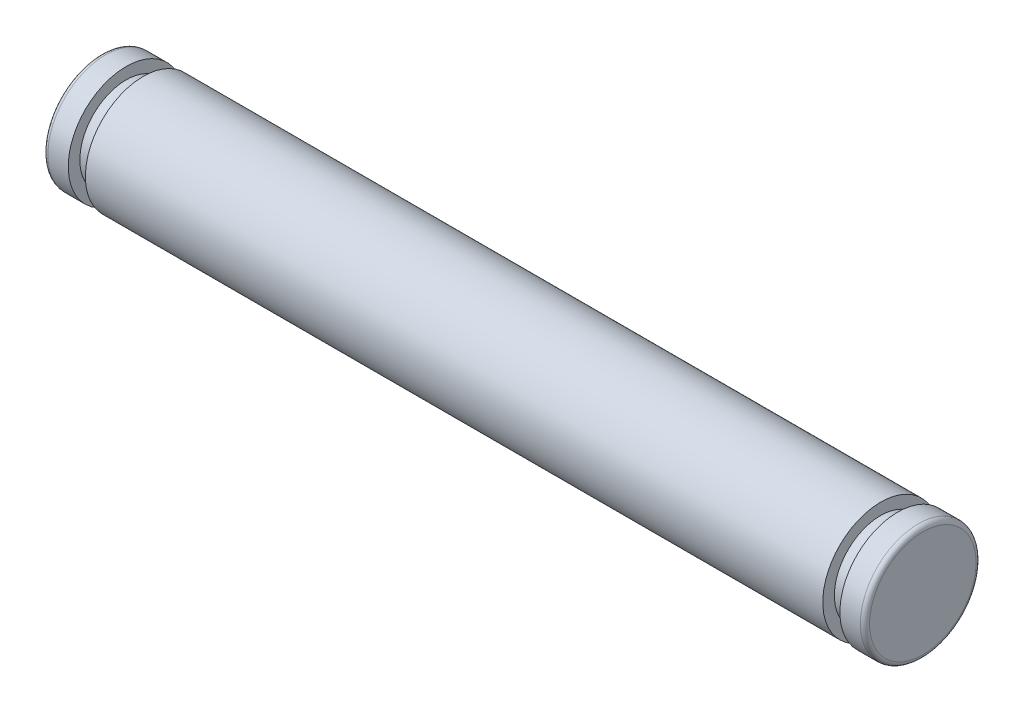
ISO-10303-21;
HEADER;
FILE_DESCRIPTION(('STEP AP214'),'2;1');
FILE_NAME('part.step','',(''),(''),'','','');
FILE_SCHEMA(('AUTOMOTIVE_DESIGN { 1 0 10303 214 1 1 1 1 }'));
ENDSEC;
DATA;
#1=APPLICATION_CONTEXT('core data for automotive mechanical design processes');
#2=APPLICATION_PROTOCOL_DEFINITION('international standard','automotive_design',2000,#1);
#3=PRODUCT_CONTEXT('',#1,'mechanical');
#4=PRODUCT('Part','Part','',(#3));
#5=PRODUCT_RELATED_PRODUCT_CATEGORY('part','',(#4));
#6=PRODUCT_DEFINITION_FORMATION('','',#4);
#7=PRODUCT_DEFINITION_CONTEXT('part definition',#1,'design');
#8=PRODUCT_DEFINITION('design','',#6,#7);
#9=PRODUCT_DEFINITION_SHAPE('','',#8);
#10=(LENGTH_UNIT() NAMED_UNIT(*) SI_UNIT(.MILLI.,.METRE.));
#11=(NAMED_UNIT(*) PLANE_ANGLE_UNIT() SI_UNIT($,.RADIAN.));
#12=(NAMED_UNIT(*) SI_UNIT($,.STERADIAN.) SOLID_ANGLE_UNIT());
#13=UNCERTAINTY_MEASURE_WITH_UNIT(LENGTH_MEASURE(1.E-05),#10,'distance_accuracy_value','');
#14=(GEOMETRIC_REPRESENTATION_CONTEXT(3) GLOBAL_UNCERTAINTY_ASSIGNED_CONTEXT((#13)) GLOBAL_UNIT_ASSIGNED_CONTEXT((#10,
#11,#12)) REPRESENTATION_CONTEXT('',''));
#15=CARTESIAN_POINT('',(0.,0.,0.));
#16=DIRECTION('',(0.,0.,1.));
#17=DIRECTION('',(1.,0.,0.));
#18=AXIS2_PLACEMENT_3D('',#15,#16,#17);
#19=CARTESIAN_POINT('',(-17.75,0.,-2.3));
#20=DIRECTION('',(-1.,0.,0.));
#21=DIRECTION('',(0.,0.,1.));
#22=AXIS2_PLACEMENT_3D('',#19,#20,#21);
#23=PLANE('',#22);
#24=CARTESIAN_POINT('',(-17.75,0.,0.));
#25=DIRECTION('',(1.,0.,0.));
#26=DIRECTION('',(0.,0.,-1.));
#27=AXIS2_PLACEMENT_3D('',#24,#25,#26);
#28=CIRCLE('',#27,2.3);
#29=CARTESIAN_POINT('',(-17.75,0.,-2.3));
#30=VERTEX_POINT('',#29);
#31=EDGE_CURVE('E10',#30,#30,#28,.T.);
#32=ORIENTED_EDGE('',*,*,#31,.F.);
#33=EDGE_LOOP('',(#32));
#34=FACE_BOUND('',#33,.T.);
#35=ADVANCED_FACE('F35',(#34),#23,.T.);
#36=CARTESIAN_POINT('',(-17.55,0.,0.));
#37=DIRECTION('',(1.,0.,0.));
#38=DIRECTION('',(0.,0.,-1.));
#39=AXIS2_PLACEMENT_3D('',#36,#37,#38);
#40=TOROIDAL_SURFACE('',#39,2.3,0.200000000000001);
#41=ORIENTED_EDGE('',*,*,#31,.T.);
#42=EDGE_LOOP('',(#41));
#43=FACE_BOUND('',#42,.T.);
#44=CARTESIAN_POINT('',(-17.55,0.,0.));
#45=DIRECTION('',(1.,0.,0.));
#46=DIRECTION('',(0.,0.,-1.));
#47=AXIS2_PLACEMENT_3D('',#44,#45,#46);
#48=CIRCLE('',#47,2.5);
#49=CARTESIAN_POINT('',(-17.55,0.,-2.5));
#50=VERTEX_POINT('',#49);
#51=EDGE_CURVE('E41',#50,#50,#48,.T.);
#52=ORIENTED_EDGE('',*,*,#51,.F.);
#53=EDGE_LOOP('',(#52));
#54=FACE_BOUND('',#53,.T.);
#55=ADVANCED_FACE('F95',(#43,#54),#40,.T.);
#56=CARTESIAN_POINT('',(17.75,0.,0.));
#57=DIRECTION('',(1.,0.,0.));
#58=DIRECTION('',(0.,0.,-1.));
#59=AXIS2_PLACEMENT_3D('',#56,#57,#58);
#60=CYLINDRICAL_SURFACE('',#59,2.5);
#61=ORIENTED_EDGE('',*,*,#51,.T.);
#62=EDGE_LOOP('',(#61));
#63=FACE_BOUND('',#62,.T.);
#64=CARTESIAN_POINT('',(-16.667,0.,0.));
#65=DIRECTION('',(1.,0.,0.));
#66=DIRECTION('',(0.,0.,-1.));
#67=AXIS2_PLACEMENT_3D('',#64,#65,#66);
#68=CIRCLE('',#67,2.5);
#69=CARTESIAN_POINT('',(-16.667,0.,-2.5));
#70=VERTEX_POINT('',#69);
#71=EDGE_CURVE('E45',#70,#70,#68,.T.);
#72=ORIENTED_EDGE('',*,*,#71,.F.);
#73=EDGE_LOOP('',(#72));
#74=FACE_BOUND('',#73,.T.);
#75=ADVANCED_FACE('F100',(#63,#74),#60,.T.);
#76=CARTESIAN_POINT('',(-16.667,0.,-2.));
#77=DIRECTION('',(1.,0.,0.));
#78=DIRECTION('',(0.,0.,-1.));
#79=AXIS2_PLACEMENT_3D('',#76,#77,#78);
#80=PLANE('',#79);
#81=ORIENTED_EDGE('',*,*,#71,.T.);
#82=EDGE_LOOP('',(#81));
#83=FACE_BOUND('',#82,.T.);
#84=CARTESIAN_POINT('',(-16.667,0.,0.));
#85=DIRECTION('',(1.,0.,0.));
#86=DIRECTION('',(0.,0.,-1.));
#87=AXIS2_PLACEMENT_3D('',#84,#85,#86);
#88=CIRCLE('',#87,2.);
#89=CARTESIAN_POINT('',(-16.667,0.,-2.));
#90=VERTEX_POINT('',#89);
#91=EDGE_CURVE('E49',#90,#90,#88,.T.);
#92=ORIENTED_EDGE('',*,*,#91,.F.);
#93=EDGE_LOOP('',(#92));
#94=FACE_BOUND('',#93,.T.);
#95=ADVANCED_FACE('F104',(#83,#94),#80,.T.);
#96=CARTESIAN_POINT('',(17.75,0.,0.));
#97=DIRECTION('',(1.,0.,0.));
#98=DIRECTION('',(0.,0.,-1.));
#99=AXIS2_PLACEMENT_3D('',#96,#97,#98);
#100=CYLINDRICAL_SURFACE('',#99,2.);
#101=ORIENTED_EDGE('',*,*,#91,.T.);
#102=EDGE_LOOP('',(#101));
#103=FACE_BOUND('',#102,.T.);
#104=CARTESIAN_POINT('',(-15.927,0.,0.));
#105=DIRECTION('',(1.,0.,0.));
#106=DIRECTION('',(0.,0.,-1.));
#107=AXIS2_PLACEMENT_3D('',#104,#105,#106);
#108=CIRCLE('',#107,2.);
#109=CARTESIAN_POINT('',(-15.927,0.,-2.));
#110=VERTEX_POINT('',#109);
#111=EDGE_CURVE('E54',#110,#110,#108,.T.);
#112=ORIENTED_EDGE('',*,*,#111,.F.);
#113=EDGE_LOOP('',(#112));
#114=FACE_BOUND('',#113,.T.);
#115=ADVANCED_FACE('F110',(#103,#114),#100,.T.);
#116=CARTESIAN_POINT('',(-15.927,0.,-2.5));
#117=DIRECTION('',(-1.,0.,0.));
#118=DIRECTION('',(0.,0.,1.));
#119=AXIS2_PLACEMENT_3D('',#116,#117,#118);
#120=PLANE('',#119);
#121=ORIENTED_EDGE('',*,*,#111,.T.);
#122=EDGE_LOOP('',(#121));
#123=FACE_BOUND('',#122,.T.);
#124=CARTESIAN_POINT('',(-15.927,0.,0.));
#125=DIRECTION('',(1.,0.,0.));
#126=DIRECTION('',(0.,0.,-1.));
#127=AXIS2_PLACEMENT_3D('',#124,#125,#126);
#128=CIRCLE('',#127,2.5);
#129=CARTESIAN_POINT('',(-15.927,0.,-2.5));
#130=VERTEX_POINT('',#129);
#131=EDGE_CURVE('E57',#130,#130,#128,.T.);
#132=ORIENTED_EDGE('',*,*,#131,.F.);
#133=EDGE_LOOP('',(#132));
#134=FACE_BOUND('',#133,.T.);
#135=ADVANCED_FACE('F114',(#123,#134),#120,.T.);
#136=CARTESIAN_POINT('',(17.75,0.,0.));
#137=DIRECTION('',(1.,0.,0.));
#138=DIRECTION('',(0.,0.,-1.));
#139=AXIS2_PLACEMENT_3D('',#136,#137,#138);
#140=CYLINDRICAL_SURFACE('',#139,2.5);
#141=ORIENTED_EDGE('',*,*,#131,.T.);
#142=EDGE_LOOP('',(#141));
#143=FACE_BOUND('',#142,.T.);
#144=CARTESIAN_POINT('',(15.927,0.,0.));
#145=DIRECTION('',(1.,0.,0.));
#146=DIRECTION('',(0.,0.,-1.));
#147=AXIS2_PLACEMENT_3D('',#144,#145,#146);
#148=CIRCLE('',#147,2.5);
#149=CARTESIAN_POINT('',(15.927,0.,-2.5));
#150=VERTEX_POINT('',#149);
#151=EDGE_CURVE('E60',#150,#150,#148,.T.);
#152=ORIENTED_EDGE('',*,*,#151,.F.);
#153=EDGE_LOOP('',(#152));
#154=FACE_BOUND('',#153,.T.);
#155=ADVANCED_FACE('F118',(#143,#154),#140,.T.);
#156=CARTESIAN_POINT('',(15.927,0.,-2.5));
#157=DIRECTION('',(1.,0.,0.));
#158=DIRECTION('',(0.,0.,-1.));
#159=AXIS2_PLACEMENT_3D('',#156,#157,#158);
#160=PLANE('',#159);
#161=ORIENTED_EDGE('',*,*,#151,.T.);
#162=EDGE_LOOP('',(#161));
#163=FACE_BOUND('',#162,.T.);
#164=CARTESIAN_POINT('',(15.927,0.,0.));
#165=DIRECTION('',(1.,0.,0.));
#166=DIRECTION('',(0.,0.,-1.));
#167=AXIS2_PLACEMENT_3D('',#164,#165,#166);
#168=CIRCLE('',#167,2.);
#169=CARTESIAN_POINT('',(15.927,0.,-2.));
#170=VERTEX_POINT('',#169);
#171=EDGE_CURVE('E63',#170,#170,#168,.T.);
#172=ORIENTED_EDGE('',*,*,#171,.F.);
#173=EDGE_LOOP('',(#172));
#174=FACE_BOUND('',#173,.T.);
#175=ADVANCED_FACE('F122',(#163,#174),#160,.T.);
#176=CARTESIAN_POINT('',(17.75,0.,0.));
#177=DIRECTION('',(1.,0.,0.));
#178=DIRECTION('',(0.,0.,-1.));
#179=AXIS2_PLACEMENT_3D('',#176,#177,#178);
#180=CYLINDRICAL_SURFACE('',#179,2.);
#181=ORIENTED_EDGE('',*,*,#171,.T.);
#182=EDGE_LOOP('',(#181));
#183=FACE_BOUND('',#182,.T.);
#184=CARTESIAN_POINT('',(16.667,0.,0.));
#185=DIRECTION('',(1.,0.,0.));
#186=DIRECTION('',(0.,0.,-1.));
#187=AXIS2_PLACEMENT_3D('',#184,#185,#186);
#188=CIRCLE('',#187,2.);
#189=CARTESIAN_POINT('',(16.667,0.,-2.));
#190=VERTEX_POINT('',#189);
#191=EDGE_CURVE('E66',#190,#190,#188,.T.);
#192=ORIENTED_EDGE('',*,*,#191,.F.);
#193=EDGE_LOOP('',(#192));
#194=FACE_BOUND('',#193,.T.);
#195=ADVANCED_FACE('F126',(#183,#194),#180,.T.);
#196=CARTESIAN_POINT('',(16.667,0.,-2.));
#197=DIRECTION('',(-1.,0.,0.));
#198=DIRECTION('',(0.,0.,1.));
#199=AXIS2_PLACEMENT_3D('',#196,#197,#198);
#200=PLANE('',#199);
#201=ORIENTED_EDGE('',*,*,#191,.T.);
#202=EDGE_LOOP('',(#201));
#203=FACE_BOUND('',#202,.T.);
#204=CARTESIAN_POINT('',(16.667,0.,0.));
#205=DIRECTION('',(1.,0.,0.));
#206=DIRECTION('',(0.,0.,-1.));
#207=AXIS2_PLACEMENT_3D('',#204,#205,#206);
#208=CIRCLE('',#207,2.5);
#209=CARTESIAN_POINT('',(16.667,0.,-2.5));
#210=VERTEX_POINT('',#209);
#211=EDGE_CURVE('E69',#210,#210,#208,.T.);
#212=ORIENTED_EDGE('',*,*,#211,.F.);
#213=EDGE_LOOP('',(#212));
#214=FACE_BOUND('',#213,.T.);
#215=ADVANCED_FACE('F91',(#203,#214),#200,.T.);
#216=CARTESIAN_POINT('',(17.75,0.,0.));
#217=DIRECTION('',(1.,0.,0.));
#218=DIRECTION('',(0.,0.,-1.));
#219=AXIS2_PLACEMENT_3D('',#216,#217,#218);
#220=CYLINDRICAL_SURFACE('',#219,2.50000000000001);
#221=ORIENTED_EDGE('',*,*,#211,.T.);
#222=EDGE_LOOP('',(#221));
#223=FACE_BOUND('',#222,.T.);
#224=CARTESIAN_POINT('',(17.55,0.,0.));
#225=DIRECTION('',(1.,0.,0.));
#226=DIRECTION('',(0.,0.,-1.));
#227=AXIS2_PLACEMENT_3D('',#224,#225,#226);
#228=CIRCLE('',#227,2.50000000000001);
#229=CARTESIAN_POINT('',(17.55,0.,-2.5));
#230=VERTEX_POINT('',#229);
#231=EDGE_CURVE('E72',#230,#230,#228,.T.);
#232=ORIENTED_EDGE('',*,*,#231,.F.);
#233=EDGE_LOOP('',(#232));
#234=FACE_BOUND('',#233,.T.);
#235=ADVANCED_FACE('F83',(#223,#234),#220,.T.);
#236=CARTESIAN_POINT('',(17.55,0.,0.));
#237=DIRECTION('',(1.,0.,0.));
#238=DIRECTION('',(0.,0.,-1.));
#239=AXIS2_PLACEMENT_3D('',#236,#237,#238);
#240=TOROIDAL_SURFACE('',#239,2.3,0.200000000000001);
#241=ORIENTED_EDGE('',*,*,#231,.T.);
#242=EDGE_LOOP('',(#241));
#243=FACE_BOUND('',#242,.T.);
#244=CARTESIAN_POINT('',(17.75,0.,0.));
#245=DIRECTION('',(1.,0.,0.));
#246=DIRECTION('',(0.,0.,-1.));
#247=AXIS2_PLACEMENT_3D('',#244,#245,#246);
#248=CIRCLE('',#247,2.3);
#249=CARTESIAN_POINT('',(17.75,0.,-2.3));
#250=VERTEX_POINT('',#249);
#251=EDGE_CURVE('E75',#250,#250,#248,.T.);
#252=ORIENTED_EDGE('',*,*,#251,.F.);
#253=EDGE_LOOP('',(#252));
#254=FACE_BOUND('',#253,.T.);
#255=ADVANCED_FACE('F81',(#243,#254),#240,.T.);
#256=CARTESIAN_POINT('',(17.75,0.,-2.3));
#257=DIRECTION('',(1.,0.,0.));
#258=DIRECTION('',(0.,0.,-1.));
#259=AXIS2_PLACEMENT_3D('',#256,#257,#258);
#260=PLANE('',#259);
#261=ORIENTED_EDGE('',*,*,#251,.T.);
#262=EDGE_LOOP('',(#261));
#263=FACE_BOUND('',#262,.T.);
#264=ADVANCED_FACE('F79',(#263),#260,.T.);
#265=CLOSED_SHELL('',(#35,#55,#75,#95,#115,#135,#155,#175,#195,#215,#235,#255,#264));
#266=MANIFOLD_SOLID_BREP('B2',#265);
#267=ADVANCED_BREP_SHAPE_REPRESENTATION('',(#18,#266),#14);
#268=SHAPE_DEFINITION_REPRESENTATION(#9,#267);
ENDSEC;
END-ISO-10303-21;
